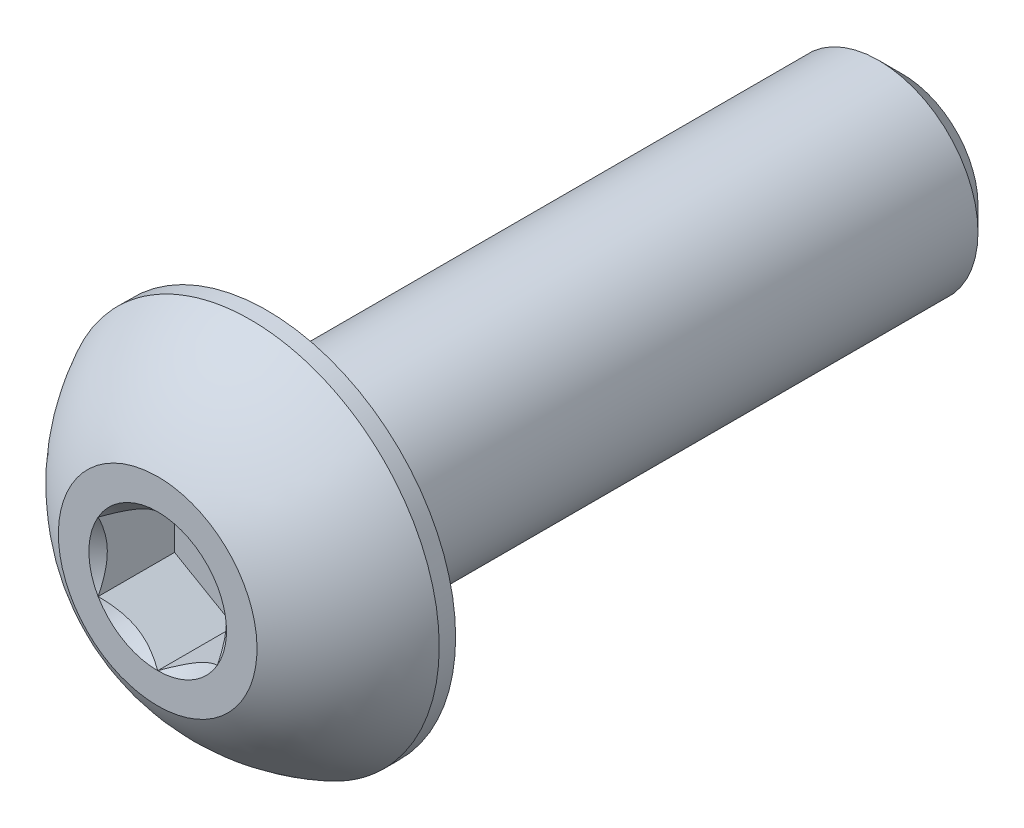
ISO-10303-21;
HEADER;
FILE_DESCRIPTION(('STEP AP214'),'2;1');
FILE_NAME('part.step','',(''),(''),'','','');
FILE_SCHEMA(('AUTOMOTIVE_DESIGN { 1 0 10303 214 1 1 1 1 }'));
ENDSEC;
DATA;
#1=APPLICATION_CONTEXT('core data for automotive mechanical design processes');
#2=APPLICATION_PROTOCOL_DEFINITION('international standard','automotive_design',2000,#1);
#3=PRODUCT_CONTEXT('',#1,'mechanical');
#4=PRODUCT('Part','Part','',(#3));
#5=PRODUCT_RELATED_PRODUCT_CATEGORY('part','',(#4));
#6=PRODUCT_DEFINITION_FORMATION('','',#4);
#7=PRODUCT_DEFINITION_CONTEXT('part definition',#1,'design');
#8=PRODUCT_DEFINITION('design','',#6,#7);
#9=PRODUCT_DEFINITION_SHAPE('','',#8);
#10=(LENGTH_UNIT() NAMED_UNIT(*) SI_UNIT(.MILLI.,.METRE.));
#11=(NAMED_UNIT(*) PLANE_ANGLE_UNIT() SI_UNIT($,.RADIAN.));
#12=(NAMED_UNIT(*) SI_UNIT($,.STERADIAN.) SOLID_ANGLE_UNIT());
#13=UNCERTAINTY_MEASURE_WITH_UNIT(LENGTH_MEASURE(1.E-05),#10,'distance_accuracy_value','');
#14=(GEOMETRIC_REPRESENTATION_CONTEXT(3) GLOBAL_UNCERTAINTY_ASSIGNED_CONTEXT((#13)) GLOBAL_UNIT_ASSIGNED_CONTEXT((#10,
#11,#12)) REPRESENTATION_CONTEXT('',''));
#15=CARTESIAN_POINT('',(0.,0.,0.));
#16=DIRECTION('',(0.,0.,1.));
#17=DIRECTION('',(1.,0.,0.));
#18=AXIS2_PLACEMENT_3D('',#15,#16,#17);
#19=CARTESIAN_POINT('',(1.5,-0.866025403784438,-1.925));
#20=DIRECTION('',(0.,0.,1.));
#21=DIRECTION('',(1.,0.,0.));
#22=AXIS2_PLACEMENT_3D('',#19,#20,#21);
#23=PLANE('',#22);
#24=DIRECTION('',(0.,1.,0.));
#25=VECTOR('',#24,1.);
#26=CARTESIAN_POINT('',(-1.5,0.866025403784438,-1.925));
#27=LINE('',#26,#25);
#28=CARTESIAN_POINT('',(-1.5,0.866025403784439,-1.925));
#29=VERTEX_POINT('',#28);
#30=CARTESIAN_POINT('',(-1.5,-0.866025403784439,-1.925));
#31=VERTEX_POINT('',#30);
#32=EDGE_CURVE('E66',#29,#31,#27,.F.);
#33=ORIENTED_EDGE('',*,*,#32,.T.);
#34=DIRECTION('',(0.866025403784439,-0.5,0.));
#35=VECTOR('',#34,1.);
#36=CARTESIAN_POINT('',(-1.5,-0.866025403784439,-1.925));
#37=LINE('',#36,#35);
#38=CARTESIAN_POINT('',(0.,-1.73205080756888,-1.925));
#39=VERTEX_POINT('',#38);
#40=EDGE_CURVE('E80',#31,#39,#37,.T.);
#41=ORIENTED_EDGE('',*,*,#40,.T.);
#42=DIRECTION('',(0.866025403784438,0.5,0.));
#43=VECTOR('',#42,1.);
#44=CARTESIAN_POINT('',(0.,-1.73205080756888,-1.925));
#45=LINE('',#44,#43);
#46=CARTESIAN_POINT('',(1.5,-0.866025403784439,-1.925));
#47=VERTEX_POINT('',#46);
#48=EDGE_CURVE('E83',#39,#47,#45,.T.);
#49=ORIENTED_EDGE('',*,*,#48,.T.);
#50=DIRECTION('',(0.,1.,0.));
#51=VECTOR('',#50,1.);
#52=CARTESIAN_POINT('',(1.5,-0.866025403784438,-1.925));
#53=LINE('',#52,#51);
#54=CARTESIAN_POINT('',(1.5,0.866025403784439,-1.925));
#55=VERTEX_POINT('',#54);
#56=EDGE_CURVE('E92',#47,#55,#53,.T.);
#57=ORIENTED_EDGE('',*,*,#56,.T.);
#58=DIRECTION('',(-0.866025403784439,0.5,0.));
#59=VECTOR('',#58,1.);
#60=CARTESIAN_POINT('',(1.5,0.866025403784439,-1.925));
#61=LINE('',#60,#59);
#62=CARTESIAN_POINT('',(0.,1.73205080756888,-1.925));
#63=VERTEX_POINT('',#62);
#64=EDGE_CURVE('E264',#55,#63,#61,.T.);
#65=ORIENTED_EDGE('',*,*,#64,.T.);
#66=DIRECTION('',(-0.866025403784438,-0.5,0.));
#67=VECTOR('',#66,1.);
#68=CARTESIAN_POINT('',(0.,1.73205080756888,-1.925));
#69=LINE('',#68,#67);
#70=EDGE_CURVE('E71',#63,#29,#69,.T.);
#71=ORIENTED_EDGE('',*,*,#70,.T.);
#72=EDGE_LOOP('',(#33,#41,#49,#57,#65,#71));
#73=FACE_BOUND('',#72,.T.);
#74=ADVANCED_FACE('F16',(#73),#23,.T.);
#75=CARTESIAN_POINT('',(-1.5,-0.866025403784439,-1.925));
#76=DIRECTION('',(-0.5,-0.866025403784439,0.));
#77=DIRECTION('',(0.866025403784439,-0.5,0.));
#78=AXIS2_PLACEMENT_3D('',#75,#76,#77);
#79=PLANE('',#78);
#80=CARTESIAN_POINT('',(-1.50000000002453,-0.866025403770048,-3.49730883349403E-11));
#81=CARTESIAN_POINT('',(-1.44844426727117,-0.895791119953617,-0.0297371504849993));
#82=CARTESIAN_POINT('',(-1.39602652187328,-0.926054519369461,-0.0577274997332096));
#83=CARTESIAN_POINT('',(-1.28914135977816,-0.9877646964775,-0.108976634295228));
#84=CARTESIAN_POINT('',(-1.23466378385068,-1.01921733960401,-0.132206913925155));
#85=CARTESIAN_POINT('',(-1.12481242363947,-1.08264005199279,-0.172000539063643));
#86=CARTESIAN_POINT('',(-1.06946660011449,-1.11459397810346,-0.188663877355987));
#87=CARTESIAN_POINT('',(-0.95755685533188,-1.17920509937865,-0.214336924391904));
#88=CARTESIAN_POINT('',(-0.900996350293105,-1.21186032218828,-0.223365789908325));
#89=CARTESIAN_POINT('',(-0.803509072843295,-1.26814462806649,-0.231512589340654));
#90=CARTESIAN_POINT('',(-0.762708138141556,-1.29170105869973,-0.232718117543908));
#91=CARTESIAN_POINT('',(-0.68117834074718,-1.33877230917235,-0.230683861819339));
#92=CARTESIAN_POINT('',(-0.640449495964758,-1.36228711867126,-0.22744309593466));
#93=CARTESIAN_POINT('',(-0.559384065201953,-1.40909026694414,-0.216702694706976));
#94=CARTESIAN_POINT('',(-0.51904787950441,-1.4323783746147,-0.20919909909419));
#95=CARTESIAN_POINT('',(-0.439052551258332,-1.47856369891149,-0.19034052638936));
#96=CARTESIAN_POINT('',(-0.399393706909126,-1.50146074337225,-0.178983896683506));
#97=CARTESIAN_POINT('',(-0.297850129661508,-1.56008695503064,-0.145281418581615));
#98=CARTESIAN_POINT('',(-0.236594120185608,-1.59545312859103,-0.120399016466317));
#99=CARTESIAN_POINT('',(-0.146523888893023,-1.64745520087378,-0.0783962697862533));
#100=CARTESIAN_POINT('',(-0.116842951449675,-1.6645914980965,-0.0636393457173694));
#101=CARTESIAN_POINT('',(-0.0580266310224323,-1.69854911652791,-0.0327784720806824));
#102=CARTESIAN_POINT('',(-0.0288909964375011,-1.71537058299853,-0.0166751634684283));
#103=CARTESIAN_POINT('',(2.46562120663875E-11,-1.73205080758311,-3.5066995750627E-11));
#104=B_SPLINE_CURVE_WITH_KNOTS('',3,(#80,#81,#82,#83,#84,#85,#86,#87,#88,#89,#90,#91,#92,#93,
#94,#95,#96,#97,#98,#99,#100,#101,#102,#103),.UNSPECIFIED.,.F.,.F.,(4,2,2,2,2,2,2,2,2,2,2,4),
(0.,0.199774419910088,0.4007123122777,0.598459990337994,0.795709985707602,0.936894690871223,
1.07811058146816,1.21945788001607,1.36086588096647,1.58533909988034,1.69726364731887,
1.80913521242832),.UNSPECIFIED.);
#105=CARTESIAN_POINT('',(-1.50000000002135,-0.866025403796764,-2.4651077774769E-11));
#106=VERTEX_POINT('',#105);
#107=CARTESIAN_POINT('',(-3.03592605946672E-11,-1.73205080760065,-1.75295343369276E-11));
#108=VERTEX_POINT('',#107);
#109=EDGE_CURVE('E19',#106,#108,#104,.T.);
#110=ORIENTED_EDGE('',*,*,#109,.T.);
#111=DIRECTION('',(0.,0.,1.));
#112=VECTOR('',#111,1.);
#113=CARTESIAN_POINT('',(0.,-1.73205080756888,-1.925));
#114=LINE('',#113,#112);
#115=EDGE_CURVE('E87',#108,#39,#114,.F.);
#116=ORIENTED_EDGE('',*,*,#115,.T.);
#117=ORIENTED_EDGE('',*,*,#40,.F.);
#118=DIRECTION('',(0.,0.,1.));
#119=VECTOR('',#118,1.);
#120=CARTESIAN_POINT('',(-1.5,-0.866025403784439,-1.925));
#121=LINE('',#120,#119);
#122=EDGE_CURVE('E58',#31,#106,#121,.T.);
#123=ORIENTED_EDGE('',*,*,#122,.T.);
#124=EDGE_LOOP('',(#110,#116,#117,#123));
#125=FACE_BOUND('',#124,.T.);
#126=ADVANCED_FACE('F88',(#125),#79,.F.);
#127=CARTESIAN_POINT('',(0.,-1.73205080756888,-1.925));
#128=DIRECTION('',(0.5,-0.866025403784438,0.));
#129=DIRECTION('',(0.866025403784438,0.5,0.));
#130=AXIS2_PLACEMENT_3D('',#127,#128,#129);
#131=PLANE('',#130);
#132=CARTESIAN_POINT('',(-2.47283241622989E-11,-1.73205080758293,-3.49712886177983E-11));
#133=CARTESIAN_POINT('',(0.0515557327287634,-1.70228509139958,-0.0297371504849972));
#134=CARTESIAN_POINT('',(0.103973478126704,-1.67202169198382,-0.0577274997332075));
#135=CARTESIAN_POINT('',(0.210858640221864,-1.61031151487585,-0.108976634295226));
#136=CARTESIAN_POINT('',(0.265336216149329,-1.57885887174931,-0.132206913925153));
#137=CARTESIAN_POINT('',(0.375187576360524,-1.51543615936052,-0.172000539063641));
#138=CARTESIAN_POINT('',(0.430533399885509,-1.48348223324986,-0.188663877355984));
#139=CARTESIAN_POINT('',(0.542443144668122,-1.41887111197467,-0.214336924391901));
#140=CARTESIAN_POINT('',(0.599003649706896,-1.38621588916504,-0.223365789908323));
#141=CARTESIAN_POINT('',(0.696490927156706,-1.32993158328682,-0.231512589340651));
#142=CARTESIAN_POINT('',(0.737291861858445,-1.30637515265359,-0.232718117543906));
#143=CARTESIAN_POINT('',(0.818821659252821,-1.25930390218097,-0.230683861819337));
#144=CARTESIAN_POINT('',(0.859550504035243,-1.23578909268205,-0.227443095934658));
#145=CARTESIAN_POINT('',(0.940615934798048,-1.18898594440918,-0.216702694706974));
#146=CARTESIAN_POINT('',(0.980952120495591,-1.16569783673862,-0.209199099094188));
#147=CARTESIAN_POINT('',(1.06094744874167,-1.11951251244183,-0.190340526389358));
#148=CARTESIAN_POINT('',(1.10060629309087,-1.09661546798107,-0.178983896683504));
#149=CARTESIAN_POINT('',(1.20214987033849,-1.03798925632268,-0.145281418581614));
#150=CARTESIAN_POINT('',(1.26340587981439,-1.00262308276228,-0.120399016466316));
#151=CARTESIAN_POINT('',(1.35347611110698,-0.950621010479539,-0.0783962697862523));
#152=CARTESIAN_POINT('',(1.38315704855032,-0.933484713256822,-0.0636393457173685));
#153=CARTESIAN_POINT('',(1.44197336897757,-0.89952709482541,-0.0327784720806818));
#154=CARTESIAN_POINT('',(1.4711090035625,-0.882705628354789,-0.0166751634684277));
#155=CARTESIAN_POINT('',(1.50000000002466,-0.866025403770206,-3.50662371950392E-11));
#156=B_SPLINE_CURVE_WITH_KNOTS('',3,(#132,#133,#134,#135,#136,#137,#138,#139,#140,#141,#142,
#143,#144,#145,#146,#147,#148,#149,#150,#151,#152,#153,#154,#155),.UNSPECIFIED.,.F.,.F.,(4,2,2,
2,2,2,2,2,2,2,2,4),(0.,0.199774419910088,0.400712312277699,0.598459990337993,0.795709985707601,
0.936894690871222,1.07811058146816,1.21945788001607,1.36086588096647,1.58533909988034,
1.69726364731887,1.80913521242832),.UNSPECIFIED.);
#157=CARTESIAN_POINT('',(1.50000000001233,-0.866025403826621,-1.7529131224469E-11));
#158=VERTEX_POINT('',#157);
#159=EDGE_CURVE('E201',#108,#158,#156,.T.);
#160=ORIENTED_EDGE('',*,*,#159,.T.);
#161=DIRECTION('',(0.,0.,-1.));
#162=VECTOR('',#161,1.);
#163=CARTESIAN_POINT('',(1.5,-0.866025403784439,-1.925));
#164=LINE('',#163,#162);
#165=EDGE_CURVE('E96',#158,#47,#164,.T.);
#166=ORIENTED_EDGE('',*,*,#165,.T.);
#167=ORIENTED_EDGE('',*,*,#48,.F.);
#168=ORIENTED_EDGE('',*,*,#115,.F.);
#169=EDGE_LOOP('',(#160,#166,#167,#168));
#170=FACE_BOUND('',#169,.T.);
#171=ADVANCED_FACE('F94',(#170),#131,.F.);
#172=CARTESIAN_POINT('',(1.5,-0.866025403784438,-1.925));
#173=DIRECTION('',(1.,0.,0.));
#174=DIRECTION('',(0.,0.,-1.));
#175=AXIS2_PLACEMENT_3D('',#172,#173,#174);
#176=PLANE('',#175);
#177=CARTESIAN_POINT('',(1.4999999999998,-0.866025403812882,-3.49731948477309E-11));
#178=CARTESIAN_POINT('',(1.49999999999993,-0.806493971458483,-0.0297371504859726));
#179=CARTESIAN_POINT('',(1.49999999999998,-0.745967172639481,-0.0577274997356718));
#180=CARTESIAN_POINT('',(1.50000000000002,-0.622546818448653,-0.108976634302055));
#181=CARTESIAN_POINT('',(1.50000000000001,-0.559641532208188,-0.132206913934862));
#182=CARTESIAN_POINT('',(1.5,-0.432796107455125,-0.172000539080811));
#183=CARTESIAN_POINT('',(1.5,-0.368888255245699,-0.188663877377684));
#184=CARTESIAN_POINT('',(1.5,-0.239666012718551,-0.214336924424236));
#185=CARTESIAN_POINT('',(1.5,-0.174355567110582,-0.223365789946761));
#186=CARTESIAN_POINT('',(1.5,-0.0617869553803679,-0.231512589389946));
#187=CARTESIAN_POINT('',(1.5,-0.0146740941290628,-0.232718117598397));
#188=CARTESIAN_POINT('',(1.5,0.0794684067864031,-0.230683861885897));
#189=CARTESIAN_POINT('',(1.5,0.126498025769629,-0.227443096008093));
#190=CARTESIAN_POINT('',(1.5,0.22010432228685,-0.21670269479537));
#191=CARTESIAN_POINT('',(1.5,0.266680537614034,-0.209199099190673));
#192=CARTESIAN_POINT('',(1.5,0.359051186180354,-0.190340526502742));
#193=CARTESIAN_POINT('',(1.5,0.404845275088565,-0.178983896805698));
#194=CARTESIAN_POINT('',(1.5,0.522097698449399,-0.145281418704612));
#195=CARTESIAN_POINT('',(1.5,0.592830045625335,-0.120399016572433));
#196=CARTESIAN_POINT('',(1.5,0.69683419026976,-0.0783962698582894));
#197=CARTESIAN_POINT('',(1.5,0.731106784740956,-0.0636393457765502));
#198=CARTESIAN_POINT('',(1.5,0.799022021654026,-0.0327784721118594));
#199=CARTESIAN_POINT('',(1.5,0.832664954619755,-0.0166751634844621));
#200=CARTESIAN_POINT('',(1.5,0.866025403812908,-3.5067301240063E-11));
#201=B_SPLINE_CURVE_WITH_KNOTS('',3,(#177,#178,#179,#180,#181,#182,#183,#184,#185,#186,#187,
#188,#189,#190,#191,#192,#193,#194,#195,#196,#197,#198,#199,#200),.UNSPECIFIED.,.F.,.F.,(4,2,2,
2,2,2,2,2,2,2,2,4),(0.,0.199774419877746,0.400712312213007,0.598459990242251,0.795709985580833,
0.936894690699465,1.07811058125136,1.21945787975417,1.36086588065946,1.58533909974464,
1.69726364726936,1.80913521246463),.UNSPECIFIED.);
#202=CARTESIAN_POINT('',(1.5000000000427,0.866025403774031,-1.75296331798823E-11));
#203=VERTEX_POINT('',#202);
#204=EDGE_CURVE('E183',#158,#203,#201,.T.);
#205=ORIENTED_EDGE('',*,*,#204,.T.);
#206=DIRECTION('',(0.,0.,1.));
#207=VECTOR('',#206,1.);
#208=CARTESIAN_POINT('',(1.5,0.866025403784439,-1.925));
#209=LINE('',#208,#207);
#210=EDGE_CURVE('E261',#203,#55,#209,.F.);
#211=ORIENTED_EDGE('',*,*,#210,.T.);
#212=ORIENTED_EDGE('',*,*,#56,.F.);
#213=ORIENTED_EDGE('',*,*,#165,.F.);
#214=EDGE_LOOP('',(#205,#211,#212,#213));
#215=FACE_BOUND('',#214,.T.);
#216=ADVANCED_FACE('F173',(#215),#176,.F.);
#217=CARTESIAN_POINT('',(1.5,0.866025403784439,-1.925));
#218=DIRECTION('',(0.5,0.866025403784439,0.));
#219=DIRECTION('',(-0.866025403784439,0.5,0.));
#220=AXIS2_PLACEMENT_3D('',#217,#218,#219);
#221=PLANE('',#220);
#222=CARTESIAN_POINT('',(1.50000000002453,0.866025403770048,-3.4973253111955E-11));
#223=CARTESIAN_POINT('',(1.44844426727117,0.895791119953617,-0.0297371504849994));
#224=CARTESIAN_POINT('',(1.39602652187328,0.926054519369461,-0.0577274997332097));
#225=CARTESIAN_POINT('',(1.28914135977816,0.987764696477501,-0.108976634295228));
#226=CARTESIAN_POINT('',(1.23466378385068,1.01921733960401,-0.132206913925155));
#227=CARTESIAN_POINT('',(1.12481242363947,1.08264005199279,-0.172000539063643));
#228=CARTESIAN_POINT('',(1.06946660011449,1.11459397810346,-0.188663877355987));
#229=CARTESIAN_POINT('',(0.95755685533188,1.17920509937865,-0.214336924391904));
#230=CARTESIAN_POINT('',(0.900996350293104,1.21186032218828,-0.223365789908325));
#231=CARTESIAN_POINT('',(0.803509072843295,1.26814462806649,-0.231512589340654));
#232=CARTESIAN_POINT('',(0.762708138141556,1.29170105869973,-0.232718117543908));
#233=CARTESIAN_POINT('',(0.68117834074718,1.33877230917235,-0.230683861819339));
#234=CARTESIAN_POINT('',(0.640449495964758,1.36228711867126,-0.22744309593466));
#235=CARTESIAN_POINT('',(0.559384065201953,1.40909026694414,-0.216702694706976));
#236=CARTESIAN_POINT('',(0.51904787950441,1.4323783746147,-0.20919909909419));
#237=CARTESIAN_POINT('',(0.439052551258333,1.47856369891149,-0.19034052638936));
#238=CARTESIAN_POINT('',(0.399393706909126,1.50146074337225,-0.178983896683506));
#239=CARTESIAN_POINT('',(0.297850129661507,1.56008695503064,-0.145281418581616));
#240=CARTESIAN_POINT('',(0.236594120185608,1.59545312859103,-0.120399016466317));
#241=CARTESIAN_POINT('',(0.146523888893023,1.64745520087378,-0.0783962697862531));
#242=CARTESIAN_POINT('',(0.116842951449674,1.6645914980965,-0.0636393457173692));
#243=CARTESIAN_POINT('',(0.0580266310224316,1.69854911652791,-0.0327784720806821));
#244=CARTESIAN_POINT('',(0.0288909964375004,1.71537058299853,-0.0166751634684281));
#245=CARTESIAN_POINT('',(-2.46568834570738E-11,1.73205080758311,-3.50665978158375E-11));
#246=B_SPLINE_CURVE_WITH_KNOTS('',3,(#222,#223,#224,#225,#226,#227,#228,#229,#230,#231,#232,
#233,#234,#235,#236,#237,#238,#239,#240,#241,#242,#243,#244,#245),.UNSPECIFIED.,.F.,.F.,(4,2,2,
2,2,2,2,2,2,2,2,4),(0.,0.199774419910088,0.400712312277699,0.598459990337994,0.795709985707602,
0.936894690871222,1.07811058146816,1.21945788001607,1.36086588096647,1.58533909988034,
1.69726364731887,1.80913521242832),.UNSPECIFIED.);
#247=CARTESIAN_POINT('',(3.03590397906963E-11,1.73205080760065,-1.75294164449582E-11));
#248=VERTEX_POINT('',#247);
#249=EDGE_CURVE('E177',#203,#248,#246,.T.);
#250=ORIENTED_EDGE('',*,*,#249,.T.);
#251=DIRECTION('',(0.,0.,1.));
#252=VECTOR('',#251,1.);
#253=CARTESIAN_POINT('',(0.,1.73205080756888,-1.925));
#254=LINE('',#253,#252);
#255=EDGE_CURVE('E256',#248,#63,#254,.F.);
#256=ORIENTED_EDGE('',*,*,#255,.T.);
#257=ORIENTED_EDGE('',*,*,#64,.F.);
#258=ORIENTED_EDGE('',*,*,#210,.F.);
#259=EDGE_LOOP('',(#250,#256,#257,#258));
#260=FACE_BOUND('',#259,.T.);
#261=ADVANCED_FACE('F169',(#260),#221,.F.);
#262=CARTESIAN_POINT('',(0.,1.73205080756888,-1.925));
#263=DIRECTION('',(-0.5,0.866025403784438,0.));
#264=DIRECTION('',(-0.866025403784438,-0.5,0.));
#265=AXIS2_PLACEMENT_3D('',#262,#263,#264);
#266=PLANE('',#265);
#267=CARTESIAN_POINT('',(2.47278634993487E-11,1.73205080758293,-3.49716904690521E-11));
#268=CARTESIAN_POINT('',(-0.0515557327287638,1.70228509139958,-0.0297371504849977));
#269=CARTESIAN_POINT('',(-0.103973478126705,1.67202169198382,-0.0577274997332079));
#270=CARTESIAN_POINT('',(-0.210858640221864,1.61031151487585,-0.108976634295226));
#271=CARTESIAN_POINT('',(-0.26533621614933,1.57885887174931,-0.132206913925153));
#272=CARTESIAN_POINT('',(-0.375187576360525,1.51543615936052,-0.172000539063641));
#273=CARTESIAN_POINT('',(-0.430533399885509,1.48348223324986,-0.188663877355985));
#274=CARTESIAN_POINT('',(-0.542443144668123,1.41887111197467,-0.214336924391901));
#275=CARTESIAN_POINT('',(-0.599003649706897,1.38621588916504,-0.223365789908323));
#276=CARTESIAN_POINT('',(-0.696490927156706,1.32993158328682,-0.231512589340651));
#277=CARTESIAN_POINT('',(-0.737291861858445,1.30637515265359,-0.232718117543906));
#278=CARTESIAN_POINT('',(-0.818821659252822,1.25930390218097,-0.230683861819337));
#279=CARTESIAN_POINT('',(-0.859550504035244,1.23578909268205,-0.227443095934658));
#280=CARTESIAN_POINT('',(-0.940615934798048,1.18898594440918,-0.216702694706974));
#281=CARTESIAN_POINT('',(-0.980952120495591,1.16569783673862,-0.209199099094188));
#282=CARTESIAN_POINT('',(-1.06094744874167,1.11951251244183,-0.190340526389358));
#283=CARTESIAN_POINT('',(-1.10060629309088,1.09661546798107,-0.178983896683504));
#284=CARTESIAN_POINT('',(-1.20214987033849,1.03798925632268,-0.145281418581613));
#285=CARTESIAN_POINT('',(-1.26340587981439,1.00262308276228,-0.120399016466315));
#286=CARTESIAN_POINT('',(-1.35347611110698,0.950621010479539,-0.0783962697862516));
#287=CARTESIAN_POINT('',(-1.38315704855033,0.933484713256821,-0.0636393457173678));
#288=CARTESIAN_POINT('',(-1.44197336897757,0.899527094825409,-0.0327784720806811));
#289=CARTESIAN_POINT('',(-1.4711090035625,0.882705628354789,-0.0166751634684272));
#290=CARTESIAN_POINT('',(-1.50000000002466,0.866025403770206,-3.50659196153753E-11));
#291=B_SPLINE_CURVE_WITH_KNOTS('',3,(#267,#268,#269,#270,#271,#272,#273,#274,#275,#276,#277,
#278,#279,#280,#281,#282,#283,#284,#285,#286,#287,#288,#289,#290),.UNSPECIFIED.,.F.,.F.,(4,2,2,
2,2,2,2,2,2,2,2,4),(0.,0.199774419910088,0.400712312277699,0.598459990337993,0.795709985707601,
0.936894690871222,1.07811058146816,1.21945788001607,1.36086588096647,1.58533909988034,
1.69726364731887,1.80913521242832),.UNSPECIFIED.);
#292=CARTESIAN_POINT('',(-1.50000000001233,0.86602540382662,-1.75290210342841E-11));
#293=VERTEX_POINT('',#292);
#294=EDGE_CURVE('E39',#248,#293,#291,.T.);
#295=ORIENTED_EDGE('',*,*,#294,.T.);
#296=DIRECTION('',(0.,0.,1.));
#297=VECTOR('',#296,1.);
#298=CARTESIAN_POINT('',(-1.5,0.866025403784438,-1.925));
#299=LINE('',#298,#297);
#300=EDGE_CURVE('E249',#293,#29,#299,.F.);
#301=ORIENTED_EDGE('',*,*,#300,.T.);
#302=ORIENTED_EDGE('',*,*,#70,.F.);
#303=ORIENTED_EDGE('',*,*,#255,.F.);
#304=EDGE_LOOP('',(#295,#301,#302,#303));
#305=FACE_BOUND('',#304,.T.);
#306=ADVANCED_FACE('F162',(#305),#266,.F.);
#307=CARTESIAN_POINT('',(-1.5,0.866025403784438,-1.925));
#308=DIRECTION('',(-1.,0.,0.));
#309=DIRECTION('',(0.,0.,1.));
#310=AXIS2_PLACEMENT_3D('',#307,#308,#309);
#311=PLANE('',#310);
#312=CARTESIAN_POINT('',(-1.4999999999998,0.866025403812881,-3.49736894377255E-11));
#313=CARTESIAN_POINT('',(-1.49999999999993,0.806493971458482,-0.0297371504859727));
#314=CARTESIAN_POINT('',(-1.49999999999998,0.74596717263948,-0.0577274997356719));
#315=CARTESIAN_POINT('',(-1.50000000000002,0.622546818448652,-0.108976634302056));
#316=CARTESIAN_POINT('',(-1.50000000000001,0.559641532208187,-0.132206913934863));
#317=CARTESIAN_POINT('',(-1.5,0.432796107455124,-0.172000539080812));
#318=CARTESIAN_POINT('',(-1.5,0.368888255245698,-0.188663877377684));
#319=CARTESIAN_POINT('',(-1.5,0.23966601271855,-0.214336924424236));
#320=CARTESIAN_POINT('',(-1.5,0.174355567110582,-0.223365789946761));
#321=CARTESIAN_POINT('',(-1.5,0.0617869553803675,-0.231512589389946));
#322=CARTESIAN_POINT('',(-1.5,0.0146740941290625,-0.232718117598397));
#323=CARTESIAN_POINT('',(-1.5,-0.0794684067864032,-0.230683861885897));
#324=CARTESIAN_POINT('',(-1.5,-0.126498025769629,-0.227443096008093));
#325=CARTESIAN_POINT('',(-1.5,-0.22010432228685,-0.21670269479537));
#326=CARTESIAN_POINT('',(-1.5,-0.266680537614034,-0.209199099190673));
#327=CARTESIAN_POINT('',(-1.5,-0.359051186180354,-0.190340526502742));
#328=CARTESIAN_POINT('',(-1.5,-0.404845275088566,-0.178983896805698));
#329=CARTESIAN_POINT('',(-1.5,-0.522097698449399,-0.145281418704612));
#330=CARTESIAN_POINT('',(-1.5,-0.592830045625335,-0.120399016572433));
#331=CARTESIAN_POINT('',(-1.5,-0.69683419026976,-0.0783962698582894));
#332=CARTESIAN_POINT('',(-1.5,-0.731106784740956,-0.0636393457765503));
#333=CARTESIAN_POINT('',(-1.5,-0.799022021654026,-0.0327784721118596));
#334=CARTESIAN_POINT('',(-1.5,-0.832664954619755,-0.0166751634844622));
#335=CARTESIAN_POINT('',(-1.5,-0.866025403812908,-3.50673251714009E-11));
#336=B_SPLINE_CURVE_WITH_KNOTS('',3,(#312,#313,#314,#315,#316,#317,#318,#319,#320,#321,#322,
#323,#324,#325,#326,#327,#328,#329,#330,#331,#332,#333,#334,#335),.UNSPECIFIED.,.F.,.F.,(4,2,2,
2,2,2,2,2,2,2,2,4),(0.,0.199774419877746,0.400712312213007,0.598459990242251,0.795709985580833,
0.936894690699464,1.07811058125136,1.21945787975417,1.36086588065945,1.58533909974464,
1.69726364726936,1.80913521246463),.UNSPECIFIED.);
#337=EDGE_CURVE('E142',#293,#106,#336,.T.);
#338=ORIENTED_EDGE('',*,*,#337,.T.);
#339=ORIENTED_EDGE('',*,*,#122,.F.);
#340=ORIENTED_EDGE('',*,*,#32,.F.);
#341=ORIENTED_EDGE('',*,*,#300,.F.);
#342=EDGE_LOOP('',(#338,#339,#340,#341));
#343=FACE_BOUND('',#342,.T.);
#344=ADVANCED_FACE('F158',(#343),#311,.F.);
#345=CARTESIAN_POINT('',(0.,0.,0.));
#346=DIRECTION('',(0.,0.,1.));
#347=DIRECTION('',(1.,0.,0.));
#348=AXIS2_PLACEMENT_3D('',#345,#346,#347);
#349=CONICAL_SURFACE('',#348,1.73205080761818,0.785398163519197);
#350=ORIENTED_EDGE('',*,*,#109,.F.);
#351=CARTESIAN_POINT('',(0.,0.,0.));
#352=DIRECTION('',(0.,0.,1.));
#353=DIRECTION('',(1.,0.,0.));
#354=AXIS2_PLACEMENT_3D('',#351,#352,#353);
#355=CIRCLE('',#354,1.73205080761818);
#356=EDGE_CURVE('E150',#106,#108,#355,.T.);
#357=ORIENTED_EDGE('',*,*,#356,.T.);
#358=EDGE_LOOP('',(#350,#357));
#359=FACE_BOUND('',#358,.T.);
#360=ADVANCED_FACE('F161',(#359),#349,.F.);
#361=CARTESIAN_POINT('',(0.,0.,0.));
#362=DIRECTION('',(0.,0.,1.));
#363=DIRECTION('',(1.,0.,0.));
#364=AXIS2_PLACEMENT_3D('',#361,#362,#363);
#365=CONICAL_SURFACE('',#364,1.73205080761818,0.785398163519197);
#366=ORIENTED_EDGE('',*,*,#159,.F.);
#367=CARTESIAN_POINT('',(0.,0.,0.));
#368=DIRECTION('',(0.,0.,1.));
#369=DIRECTION('',(1.,0.,0.));
#370=AXIS2_PLACEMENT_3D('',#367,#368,#369);
#371=CIRCLE('',#370,1.73205080761818);
#372=EDGE_CURVE('E302',#108,#158,#371,.T.);
#373=ORIENTED_EDGE('',*,*,#372,.T.);
#374=EDGE_LOOP('',(#366,#373));
#375=FACE_BOUND('',#374,.T.);
#376=ADVANCED_FACE('F196',(#375),#365,.F.);
#377=CARTESIAN_POINT('',(0.,0.,0.));
#378=DIRECTION('',(0.,0.,1.));
#379=DIRECTION('',(1.,0.,0.));
#380=AXIS2_PLACEMENT_3D('',#377,#378,#379);
#381=CONICAL_SURFACE('',#380,1.73205080761818,0.785398163397448);
#382=CARTESIAN_POINT('',(0.,0.,0.));
#383=DIRECTION('',(0.,0.,1.));
#384=DIRECTION('',(1.,0.,0.));
#385=AXIS2_PLACEMENT_3D('',#382,#383,#384);
#386=CIRCLE('',#385,1.73205080761818);
#387=EDGE_CURVE('E303',#158,#203,#386,.T.);
#388=ORIENTED_EDGE('',*,*,#387,.T.);
#389=ORIENTED_EDGE('',*,*,#204,.F.);
#390=EDGE_LOOP('',(#388,#389));
#391=FACE_BOUND('',#390,.T.);
#392=ADVANCED_FACE('F192',(#391),#381,.F.);
#393=CARTESIAN_POINT('',(0.,0.,0.));
#394=DIRECTION('',(0.,0.,1.));
#395=DIRECTION('',(1.,0.,0.));
#396=AXIS2_PLACEMENT_3D('',#393,#394,#395);
#397=CONICAL_SURFACE('',#396,1.73205080761818,0.785398163519197);
#398=ORIENTED_EDGE('',*,*,#249,.F.);
#399=CARTESIAN_POINT('',(0.,0.,0.));
#400=DIRECTION('',(0.,0.,1.));
#401=DIRECTION('',(1.,0.,0.));
#402=AXIS2_PLACEMENT_3D('',#399,#400,#401);
#403=CIRCLE('',#402,1.73205080761818);
#404=EDGE_CURVE('E304',#203,#248,#403,.T.);
#405=ORIENTED_EDGE('',*,*,#404,.T.);
#406=EDGE_LOOP('',(#398,#405));
#407=FACE_BOUND('',#406,.T.);
#408=ADVANCED_FACE('F189',(#407),#397,.F.);
#409=CARTESIAN_POINT('',(0.,0.,0.));
#410=DIRECTION('',(0.,0.,1.));
#411=DIRECTION('',(1.,0.,0.));
#412=AXIS2_PLACEMENT_3D('',#409,#410,#411);
#413=CONICAL_SURFACE('',#412,1.73205080761818,0.785398163519197);
#414=ORIENTED_EDGE('',*,*,#294,.F.);
#415=CARTESIAN_POINT('',(0.,0.,0.));
#416=DIRECTION('',(0.,0.,1.));
#417=DIRECTION('',(1.,0.,0.));
#418=AXIS2_PLACEMENT_3D('',#415,#416,#417);
#419=CIRCLE('',#418,1.73205080761818);
#420=EDGE_CURVE('E297',#248,#293,#419,.T.);
#421=ORIENTED_EDGE('',*,*,#420,.T.);
#422=EDGE_LOOP('',(#414,#421));
#423=FACE_BOUND('',#422,.T.);
#424=ADVANCED_FACE('F137',(#423),#413,.F.);
#425=CARTESIAN_POINT('',(0.,0.,0.));
#426=DIRECTION('',(0.,0.,1.));
#427=DIRECTION('',(1.,0.,0.));
#428=AXIS2_PLACEMENT_3D('',#425,#426,#427);
#429=CONICAL_SURFACE('',#428,1.73205080761818,0.785398163397448);
#430=ORIENTED_EDGE('',*,*,#337,.F.);
#431=CARTESIAN_POINT('',(0.,0.,0.));
#432=DIRECTION('',(0.,0.,1.));
#433=DIRECTION('',(1.,0.,0.));
#434=AXIS2_PLACEMENT_3D('',#431,#432,#433);
#435=CIRCLE('',#434,1.73205080761818);
#436=EDGE_CURVE('E122',#293,#106,#435,.T.);
#437=ORIENTED_EDGE('',*,*,#436,.T.);
#438=EDGE_LOOP('',(#430,#437));
#439=FACE_BOUND('',#438,.T.);
#440=ADVANCED_FACE('F132',(#439),#429,.F.);
#441=CARTESIAN_POINT('',(0.,-2.5,0.));
#442=DIRECTION('',(0.,0.,-1.));
#443=DIRECTION('',(-1.,0.,0.));
#444=AXIS2_PLACEMENT_3D('',#441,#442,#443);
#445=PLANE('',#444);
#446=ORIENTED_EDGE('',*,*,#420,.F.);
#447=ORIENTED_EDGE('',*,*,#404,.F.);
#448=ORIENTED_EDGE('',*,*,#387,.F.);
#449=ORIENTED_EDGE('',*,*,#372,.F.);
#450=ORIENTED_EDGE('',*,*,#356,.F.);
#451=ORIENTED_EDGE('',*,*,#436,.F.);
#452=EDGE_LOOP('',(#446,#447,#448,#449,#450,#451));
#453=FACE_BOUND('',#452,.T.);
#454=CARTESIAN_POINT('',(0.,2.5,0.));
#455=CARTESIAN_POINT('',(-0.140426104916171,2.49999377288615,0.));
#456=CARTESIAN_POINT('',(-0.280954031991962,2.48812860484106,3.15786606079497E-13));
#457=CARTESIAN_POINT('',(-0.558139658492382,2.44096074902969,-3.16166902160035E-13));
#458=CARTESIAN_POINT('',(-0.694792493265144,2.40562985309161,-1.1991938830655E-12));
#459=CARTESIAN_POINT('',(-0.960172122561447,2.31253633023374,-1.20166281841789E-12));
#460=CARTESIAN_POINT('',(-1.08890266852496,2.25478441650809,-3.21946211567848E-13));
#461=CARTESIAN_POINT('',(-1.33480476215494,2.11850293856874,3.21866212850881E-13));
#462=CARTESIAN_POINT('',(-1.45197917410753,2.03997854084975,0.));
#463=CARTESIAN_POINT('',(-1.67149637287936,1.86436525899232,0.));
#464=CARTESIAN_POINT('',(-1.77383760642256,1.76727443311113,0.));
#465=CARTESIAN_POINT('',(-1.96077108972063,1.5572853703438,0.));
#466=CARTESIAN_POINT('',(-2.04536264247664,1.44438651299413,0.));
#467=CARTESIAN_POINT('',(-2.19438926048053,1.20599153577204,0.));
#468=CARTESIAN_POINT('',(-2.2588247010994,1.08049565055392,0.));
#469=CARTESIAN_POINT('',(-2.36571190425968,0.820467575206641,0.));
#470=CARTESIAN_POINT('',(-2.40816371100576,0.685935403248265,0.));
#471=CARTESIAN_POINT('',(-2.46987884513361,0.41165323576608,0.));
#472=CARTESIAN_POINT('',(-2.4891421283097,0.271903230295725,0.));
#473=CARTESIAN_POINT('',(-2.50393321907299,-0.00884700938585766,0.));
#474=CARTESIAN_POINT('',(-2.49946106942909,-0.149847241343845,0.));
#475=CARTESIAN_POINT('',(-2.46690834048228,-0.429095661105703,0.));
#476=CARTESIAN_POINT('',(-2.43882775236998,-0.567343847882638,0.));
#477=CARTESIAN_POINT('',(-2.35985521676827,-0.837163810231991,0.));
#478=CARTESIAN_POINT('',(-2.30896324519902,-0.968735578756573,0.));
#479=CARTESIAN_POINT('',(-2.1858126315262,-1.2214675666181,0.));
#480=CARTESIAN_POINT('',(-2.11355399637579,-1.34262778934316,0.));
#481=CARTESIAN_POINT('',(-1.94972129370707,-1.57109730355804,0.));
#482=CARTESIAN_POINT('',(-1.85814723400701,-1.67840660065422,0.));
#483=CARTESIAN_POINT('',(-1.65828316813495,-1.87612814061528,0.));
#484=CARTESIAN_POINT('',(-1.54999315967219,-1.96654038116456,0.));
#485=CARTESIAN_POINT('',(-1.31977122488187,-2.12790126296045,0.));
#486=CARTESIAN_POINT('',(-1.19783929677156,-2.1988499016635,0.));
#487=CARTESIAN_POINT('',(-0.943794829063063,-2.31926953799949,0.));
#488=CARTESIAN_POINT('',(-0.811682289900767,-2.36874053655201,0.));
#489=CARTESIAN_POINT('',(-0.541026888337529,-2.44480055905629,0.));
#490=CARTESIAN_POINT('',(-0.402484026226278,-2.47138958403888,0.));
#491=CARTESIAN_POINT('',(-0.122900797575727,-2.50093087897621,0.));
#492=CARTESIAN_POINT('',(0.018139568963571,-2.50388314893098,3.46961945081868E-13));
#493=CARTESIAN_POINT('',(0.298714091660324,-2.48606712714886,-3.46961960712715E-13));
#494=CARTESIAN_POINT('',(0.438248247749923,-2.46529883434335,-1.29477243391078E-12));
#495=CARTESIAN_POINT('',(0.71184938433979,-2.40063123468837,-1.13730987603765E-12));
#496=CARTESIAN_POINT('',(0.845916364605969,-2.3567319268485,0.));
#497=CARTESIAN_POINT('',(1.10477735834655,-2.24704847617179,0.));
#498=CARTESIAN_POINT('',(1.22957137303277,-2.18126433619494,-1.00916257566668E-12));
#499=CARTESIAN_POINT('',(1.46634390401786,-2.02967864834023,-1.18352788602047E-12));
#500=CARTESIAN_POINT('',(1.57832242207297,-1.94387710320556,-3.16694129312418E-13));
#501=CARTESIAN_POINT('',(1.7862852822064,-1.7546922142879,3.16694257499622E-13));
#502=CARTESIAN_POINT('',(1.8822696178108,-1.6513088633884,0.));
#503=CARTESIAN_POINT('',(2.0555193719421,-1.42989510132749,0.));
#504=CARTESIAN_POINT('',(2.13278478437748,-1.31186468539964,0.));
#505=CARTESIAN_POINT('',(2.2664032406088,-1.06450749101075,0.));
#506=CARTESIAN_POINT('',(2.32275630647994,-0.935180724474359,0.));
#507=CARTESIAN_POINT('',(2.41295047224872,-0.668901974735228,0.));
#508=CARTESIAN_POINT('',(2.4467915805466,-0.531949994377824,0.));
#509=CARTESIAN_POINT('',(2.49100125494042,-0.254308178115884,0.));
#510=CARTESIAN_POINT('',(2.50136977874099,-0.11361833547654,0.));
#511=CARTESIAN_POINT('',(2.49833983643023,0.167504919749226,0.));
#512=CARTESIAN_POINT('',(2.48494141562714,0.307938332823983,0.));
#513=CARTESIAN_POINT('',(2.43475793877014,0.584562794538375,0.));
#514=CARTESIAN_POINT('',(2.39797283569016,0.720753834646847,0.));
#515=CARTESIAN_POINT('',(2.30205936796063,0.98502964653005,0.));
#516=CARTESIAN_POINT('',(2.24293058718862,1.1131142672812,0.));
#517=CARTESIAN_POINT('',(2.10401075902967,1.3575336098139,0.));
#518=CARTESIAN_POINT('',(2.02422052292125,1.47386879269154,0.));
#519=CARTESIAN_POINT('',(1.84625229096995,1.69148114008358,0.));
#520=CARTESIAN_POINT('',(1.74807621990901,1.79275987884252,0.));
#521=CARTESIAN_POINT('',(1.53608575842464,1.97742315380663,0.));
#522=CARTESIAN_POINT('',(1.42226748721669,2.06080323621403,0.));
#523=CARTESIAN_POINT('',(1.18220372565671,2.20730286771332,0.));
#524=CARTESIAN_POINT('',(1.05595232774905,2.27041272419885,0.));
#525=CARTESIAN_POINT('',(0.79474524318476,2.37446817640476,0.));
#526=CARTESIAN_POINT('',(0.659800208998089,2.41544034072841,0.));
#527=CARTESIAN_POINT('',(0.436662637238998,2.46313736176947,0.));
#528=CARTESIAN_POINT('',(0.349919997758221,2.47694359911888,0.));
#529=CARTESIAN_POINT('',(0.175464826042706,2.49537686389633,0.));
#530=CARTESIAN_POINT('',(0.0877522938079665,2.50000389132438,0.));
#531=CARTESIAN_POINT('',(0.,2.5,0.));
#532=B_SPLINE_CURVE_WITH_KNOTS('',3,(#454,#455,#456,#457,#458,#459,#460,#461,#462,#463,#464,
#465,#466,#467,#468,#469,#470,#471,#472,#473,#474,#475,#476,#477,#478,#479,#480,#481,#482,#483,
#484,#485,#486,#487,#488,#489,#490,#491,#492,#493,#494,#495,#496,#497,#498,#499,#500,#501,#502,
#503,#504,#505,#506,#507,#508,#509,#510,#511,#512,#513,#514,#515,#516,#517,#518,#519,#520,#521,
#522,#523,#524,#525,#526,#527,#528,#529,#530,#531),.UNSPECIFIED.,.T.,.F.,(4,2,2,2,2,2,2,2,2,2,2,
2,2,2,2,2,2,2,2,2,2,2,2,2,2,2,2,2,2,2,2,2,2,2,2,2,2,2,4),(0.,0.420958019059748,
0.842422990224611,1.26368682467408,1.68484598149402,2.10604920874208,2.52726897280856,
2.94848089195443,3.36969196412426,3.7909038392729,4.21211495543997,4.63332622878055,
5.05453794675567,5.47574952765963,5.89696093807138,6.31817240620663,6.73938392938708,
7.16059543453285,7.58180692070278,8.00301840687236,8.42422991201778,8.84544143519829,
9.26665290333358,9.68786431374594,10.1090758946506,10.5302876126258,10.9514988859663,
11.3727100021334,11.793921877282,12.2151329494518,12.6363448685977,13.0575646326643,
13.4787678599123,13.8999270167319,14.3211908511815,14.742655822347,15.1636138414069,
15.4266705700074,15.689727298608),.UNSPECIFIED.);
#533=CARTESIAN_POINT('',(0.,2.5,0.));
#534=VERTEX_POINT('',#533);
#535=EDGE_CURVE('E114',#534,#534,#532,.F.);
#536=ORIENTED_EDGE('',*,*,#535,.F.);
#537=EDGE_LOOP('',(#536));
#538=FACE_BOUND('',#537,.T.);
#539=ADVANCED_FACE('F128',(#453,#538),#445,.F.);
#540=CARTESIAN_POINT('',(0.,0.,-4.65805481283422));
#541=DIRECTION('',(0.,-1.,0.));
#542=DIRECTION('',(0.,0.,-1.));
#543=AXIS2_PLACEMENT_3D('',#540,#541,#542);
#544=SPHERICAL_SURFACE('',#543,5.28653711226622);
#545=ORIENTED_EDGE('',*,*,#535,.T.);
#546=EDGE_LOOP('',(#545));
#547=FACE_BOUND('',#546,.T.);
#548=CARTESIAN_POINT('',(0.,0.,-2.3375));
#549=DIRECTION('',(0.,0.,1.));
#550=DIRECTION('',(1.,0.,0.));
#551=AXIS2_PLACEMENT_3D('',#548,#549,#550);
#552=CIRCLE('',#551,4.75);
#553=CARTESIAN_POINT('',(4.75,0.,-2.3375));
#554=VERTEX_POINT('',#553);
#555=EDGE_CURVE('E111',#554,#554,#552,.F.);
#556=ORIENTED_EDGE('',*,*,#555,.F.);
#557=EDGE_LOOP('',(#556));
#558=FACE_BOUND('',#557,.T.);
#559=ADVANCED_FACE('F124',(#547,#558),#544,.T.);
#560=CARTESIAN_POINT('',(0.,-2.5,-18.75));
#561=DIRECTION('',(0.,0.,-1.));
#562=DIRECTION('',(-1.,0.,0.));
#563=AXIS2_PLACEMENT_3D('',#560,#561,#562);
#564=PLANE('',#563);
#565=CARTESIAN_POINT('',(0.,0.,-18.7500000000682));
#566=DIRECTION('',(0.,0.,1.));
#567=DIRECTION('',(1.,0.,0.));
#568=AXIS2_PLACEMENT_3D('',#565,#566,#567);
#569=CIRCLE('',#568,1.89999999992096);
#570=CARTESIAN_POINT('',(1.89999999992096,0.,-18.7500000000682));
#571=VERTEX_POINT('',#570);
#572=EDGE_CURVE('E108',#571,#571,#569,.T.);
#573=ORIENTED_EDGE('',*,*,#572,.F.);
#574=EDGE_LOOP('',(#573));
#575=FACE_BOUND('',#574,.T.);
#576=ADVANCED_FACE('F232',(#575),#564,.T.);
#577=CARTESIAN_POINT('',(0.,0.,0.));
#578=DIRECTION('',(0.,0.,1.));
#579=DIRECTION('',(1.,0.,0.));
#580=AXIS2_PLACEMENT_3D('',#577,#578,#579);
#581=CYLINDRICAL_SURFACE('',#580,4.75);
#582=CARTESIAN_POINT('',(0.,0.,-2.75));
#583=DIRECTION('',(0.,0.,1.));
#584=DIRECTION('',(1.,0.,0.));
#585=AXIS2_PLACEMENT_3D('',#582,#583,#584);
#586=CIRCLE('',#585,4.75);
#587=CARTESIAN_POINT('',(4.75,0.,-2.75));
#588=VERTEX_POINT('',#587);
#589=EDGE_CURVE('E105',#588,#588,#586,.T.);
#590=ORIENTED_EDGE('',*,*,#589,.T.);
#591=EDGE_LOOP('',(#590));
#592=FACE_BOUND('',#591,.T.);
#593=ORIENTED_EDGE('',*,*,#555,.T.);
#594=EDGE_LOOP('',(#593));
#595=FACE_BOUND('',#594,.T.);
#596=ADVANCED_FACE('F229',(#592,#595),#581,.T.);
#597=CARTESIAN_POINT('',(0.,0.,-18.150000000162));
#598=DIRECTION('',(0.,0.,1.));
#599=DIRECTION('',(1.,0.,0.));
#600=AXIS2_PLACEMENT_3D('',#597,#598,#599);
#601=CONICAL_SURFACE('',#600,2.4999999998272,0.785398163397448);
#602=ORIENTED_EDGE('',*,*,#572,.T.);
#603=EDGE_LOOP('',(#602));
#604=FACE_BOUND('',#603,.T.);
#605=CARTESIAN_POINT('',(0.,0.,-18.15));
#606=DIRECTION('',(0.,0.,-1.));
#607=DIRECTION('',(-1.,0.,0.));
#608=AXIS2_PLACEMENT_3D('',#605,#606,#607);
#609=CIRCLE('',#608,2.5);
#610=CARTESIAN_POINT('',(-2.5,0.,-18.15));
#611=VERTEX_POINT('',#610);
#612=EDGE_CURVE('E30',#611,#611,#609,.F.);
#613=ORIENTED_EDGE('',*,*,#612,.F.);
#614=EDGE_LOOP('',(#613));
#615=FACE_BOUND('',#614,.T.);
#616=ADVANCED_FACE('F222',(#604,#615),#601,.T.);
#617=CARTESIAN_POINT('',(0.,-4.75,-2.75));
#618=DIRECTION('',(0.,0.,1.));
#619=DIRECTION('',(1.,0.,0.));
#620=AXIS2_PLACEMENT_3D('',#617,#618,#619);
#621=PLANE('',#620);
#622=CARTESIAN_POINT('',(0.,0.,-2.75));
#623=DIRECTION('',(0.,0.,-1.));
#624=DIRECTION('',(-1.,0.,0.));
#625=AXIS2_PLACEMENT_3D('',#622,#623,#624);
#626=CIRCLE('',#625,2.5);
#627=CARTESIAN_POINT('',(-2.5,0.,-2.75));
#628=VERTEX_POINT('',#627);
#629=EDGE_CURVE('E10',#628,#628,#626,.T.);
#630=ORIENTED_EDGE('',*,*,#629,.F.);
#631=EDGE_LOOP('',(#630));
#632=FACE_BOUND('',#631,.T.);
#633=ORIENTED_EDGE('',*,*,#589,.F.);
#634=EDGE_LOOP('',(#633));
#635=FACE_BOUND('',#634,.T.);
#636=ADVANCED_FACE('F216',(#632,#635),#621,.F.);
#637=CARTESIAN_POINT('',(0.,0.,-18.75));
#638=DIRECTION('',(0.,0.,-1.));
#639=DIRECTION('',(-1.,0.,0.));
#640=AXIS2_PLACEMENT_3D('',#637,#638,#639);
#641=CYLINDRICAL_SURFACE('',#640,2.5);
#642=ORIENTED_EDGE('',*,*,#629,.T.);
#643=EDGE_LOOP('',(#642));
#644=FACE_BOUND('',#643,.T.);
#645=ORIENTED_EDGE('',*,*,#612,.T.);
#646=EDGE_LOOP('',(#645));
#647=FACE_BOUND('',#646,.T.);
#648=ADVANCED_FACE('F214',(#644,#647),#641,.T.);
#649=CLOSED_SHELL('',(#74,#126,#171,#216,#261,#306,#344,#360,#376,#392,#408,#424,#440,#539,#559,
#576,#596,#616,#636,#648));
#650=MANIFOLD_SOLID_BREP('B1',#649);
#651=ADVANCED_BREP_SHAPE_REPRESENTATION('',(#18,#650),#14);
#652=SHAPE_DEFINITION_REPRESENTATION(#9,#651);
ENDSEC;
END-ISO-10303-21;
